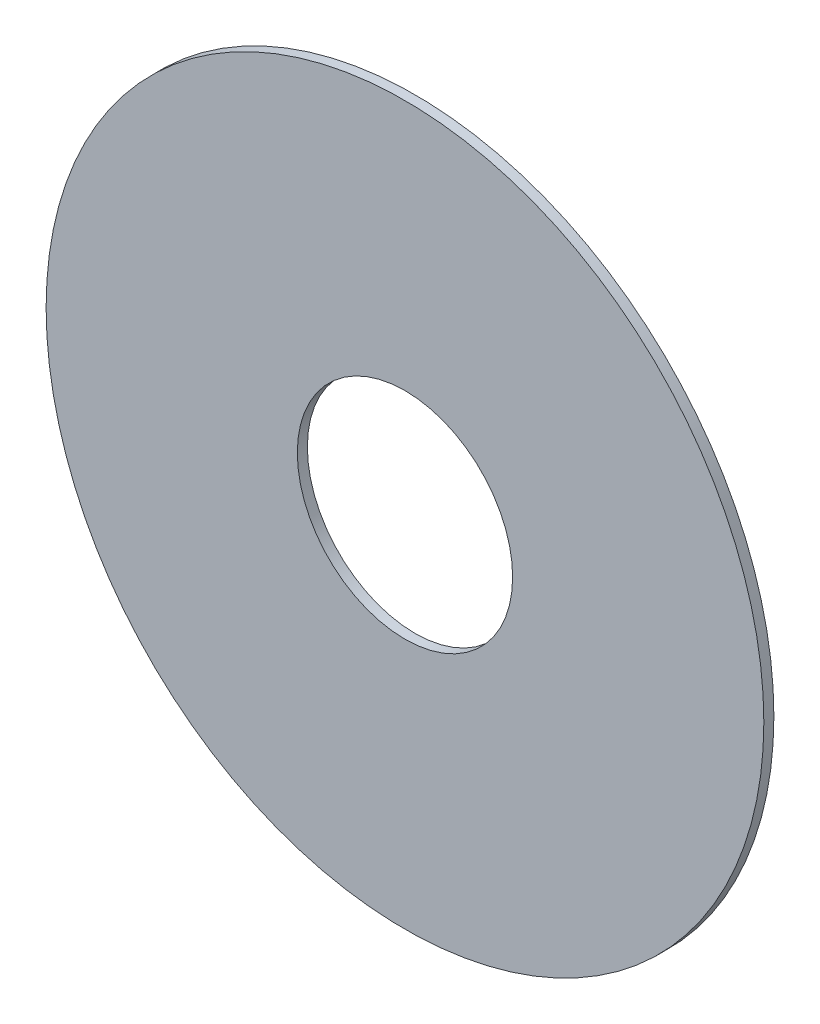
ISO-10303-21;
HEADER;
FILE_DESCRIPTION(('STEP AP214'),'2;1');
FILE_NAME('part.step','',(''),(''),'','','');
FILE_SCHEMA(('AUTOMOTIVE_DESIGN { 1 0 10303 214 1 1 1 1 }'));
ENDSEC;
DATA;
#1=APPLICATION_CONTEXT('core data for automotive mechanical design processes');
#2=APPLICATION_PROTOCOL_DEFINITION('international standard','automotive_design',2000,#1);
#3=PRODUCT_CONTEXT('',#1,'mechanical');
#4=PRODUCT('Part','Part','',(#3));
#5=PRODUCT_RELATED_PRODUCT_CATEGORY('part','',(#4));
#6=PRODUCT_DEFINITION_FORMATION('','',#4);
#7=PRODUCT_DEFINITION_CONTEXT('part definition',#1,'design');
#8=PRODUCT_DEFINITION('design','',#6,#7);
#9=PRODUCT_DEFINITION_SHAPE('','',#8);
#10=(LENGTH_UNIT() NAMED_UNIT(*) SI_UNIT(.MILLI.,.METRE.));
#11=(NAMED_UNIT(*) PLANE_ANGLE_UNIT() SI_UNIT($,.RADIAN.));
#12=(NAMED_UNIT(*) SI_UNIT($,.STERADIAN.) SOLID_ANGLE_UNIT());
#13=UNCERTAINTY_MEASURE_WITH_UNIT(LENGTH_MEASURE(1.E-05),#10,'distance_accuracy_value','');
#14=(GEOMETRIC_REPRESENTATION_CONTEXT(3) GLOBAL_UNCERTAINTY_ASSIGNED_CONTEXT((#13)) GLOBAL_UNIT_ASSIGNED_CONTEXT((#10,
#11,#12)) REPRESENTATION_CONTEXT('',''));
#15=CARTESIAN_POINT('',(0.,0.,0.));
#16=DIRECTION('',(0.,0.,1.));
#17=DIRECTION('',(1.,0.,0.));
#18=AXIS2_PLACEMENT_3D('',#15,#16,#17);
#19=CARTESIAN_POINT('',(170.18,-120.396,-0.045));
#20=DIRECTION('',(0.,0.,-1.));
#21=DIRECTION('',(0.,-1.,0.));
#22=AXIS2_PLACEMENT_3D('',#19,#20,#21);
#23=CYLINDRICAL_SURFACE('',#22,0.375);
#24=CARTESIAN_POINT('',(170.18,-120.396,1.67));
#25=DIRECTION('',(0.,0.,-1.));
#26=DIRECTION('',(0.,-1.,0.));
#27=AXIS2_PLACEMENT_3D('',#24,#25,#26);
#28=CIRCLE('',#27,0.375);
#29=CARTESIAN_POINT('',(170.18,-120.771,1.67));
#30=VERTEX_POINT('',#29);
#31=EDGE_CURVE('E20',#30,#30,#28,.T.);
#32=ORIENTED_EDGE('',*,*,#31,.T.);
#33=DIRECTION('',(0.,0.,1.));
#34=VECTOR('',#33,1.);
#35=CARTESIAN_POINT('',(170.18,-120.771,-0.045));
#36=LINE('',#35,#34);
#37=CARTESIAN_POINT('',(170.18,-120.771,1.705));
#38=VERTEX_POINT('',#37);
#39=EDGE_CURVE('E11',#30,#38,#36,.T.);
#40=ORIENTED_EDGE('',*,*,#39,.T.);
#41=CARTESIAN_POINT('',(170.18,-120.396,1.705));
#42=DIRECTION('',(0.,0.,-1.));
#43=DIRECTION('',(0.,-1.,0.));
#44=AXIS2_PLACEMENT_3D('',#41,#42,#43);
#45=CIRCLE('',#44,0.375);
#46=EDGE_CURVE('E68',#38,#38,#45,.T.);
#47=ORIENTED_EDGE('',*,*,#46,.F.);
#48=ORIENTED_EDGE('',*,*,#39,.F.);
#49=EDGE_LOOP('',(#32,#40,#47,#48));
#50=FACE_BOUND('',#49,.T.);
#51=ADVANCED_FACE('F17',(#50),#23,.F.);
#52=CARTESIAN_POINT('',(170.18,-120.396,1.67));
#53=DIRECTION('',(0.,0.,1.));
#54=DIRECTION('',(1.,0.,0.));
#55=AXIS2_PLACEMENT_3D('',#52,#53,#54);
#56=PLANE('',#55);
#57=ORIENTED_EDGE('',*,*,#31,.F.);
#58=EDGE_LOOP('',(#57));
#59=FACE_BOUND('',#58,.T.);
#60=CARTESIAN_POINT('',(170.18,-120.396,1.67));
#61=DIRECTION('',(0.,0.,1.));
#62=DIRECTION('',(1.,0.,0.));
#63=AXIS2_PLACEMENT_3D('',#60,#61,#62);
#64=CIRCLE('',#63,1.25);
#65=CARTESIAN_POINT('',(171.43,-120.396,1.67));
#66=VERTEX_POINT('',#65);
#67=EDGE_CURVE('E57',#66,#66,#64,.T.);
#68=ORIENTED_EDGE('',*,*,#67,.F.);
#69=EDGE_LOOP('',(#68));
#70=FACE_BOUND('',#69,.T.);
#71=ADVANCED_FACE('F102',(#59,#70),#56,.F.);
#72=CARTESIAN_POINT('',(170.18,-120.396,1.705));
#73=DIRECTION('',(0.,0.,1.));
#74=DIRECTION('',(1.,0.,0.));
#75=AXIS2_PLACEMENT_3D('',#72,#73,#74);
#76=PLANE('',#75);
#77=ORIENTED_EDGE('',*,*,#46,.T.);
#78=EDGE_LOOP('',(#77));
#79=FACE_BOUND('',#78,.T.);
#80=CARTESIAN_POINT('',(170.18,-120.396,1.705));
#81=DIRECTION('',(0.,0.,1.));
#82=DIRECTION('',(1.,0.,0.));
#83=AXIS2_PLACEMENT_3D('',#80,#81,#82);
#84=CIRCLE('',#83,1.25);
#85=CARTESIAN_POINT('',(171.43,-120.396,1.705));
#86=VERTEX_POINT('',#85);
#87=EDGE_CURVE('E55',#86,#86,#84,.T.);
#88=ORIENTED_EDGE('',*,*,#87,.T.);
#89=EDGE_LOOP('',(#88));
#90=FACE_BOUND('',#89,.T.);
#91=ADVANCED_FACE('F61',(#79,#90),#76,.T.);
#92=CARTESIAN_POINT('',(170.18,-120.396,1.67));
#93=DIRECTION('',(0.,0.,1.));
#94=DIRECTION('',(1.,0.,0.));
#95=AXIS2_PLACEMENT_3D('',#92,#93,#94);
#96=CYLINDRICAL_SURFACE('',#95,1.25);
#97=ORIENTED_EDGE('',*,*,#87,.F.);
#98=DIRECTION('',(0.,0.,1.));
#99=VECTOR('',#98,1.);
#100=CARTESIAN_POINT('',(171.43,-120.396,1.67));
#101=LINE('',#100,#99);
#102=EDGE_CURVE('E52',#66,#86,#101,.T.);
#103=ORIENTED_EDGE('',*,*,#102,.F.);
#104=ORIENTED_EDGE('',*,*,#67,.T.);
#105=ORIENTED_EDGE('',*,*,#102,.T.);
#106=EDGE_LOOP('',(#97,#103,#104,#105));
#107=FACE_BOUND('',#106,.T.);
#108=ADVANCED_FACE('F54',(#107),#96,.T.);
#109=CLOSED_SHELL('',(#51,#71,#91,#108));
#110=MANIFOLD_SOLID_BREP('B1',#109);
#111=ADVANCED_BREP_SHAPE_REPRESENTATION('',(#18,#110),#14);
#112=SHAPE_DEFINITION_REPRESENTATION(#9,#111);
ENDSEC;
END-ISO-10303-21;
